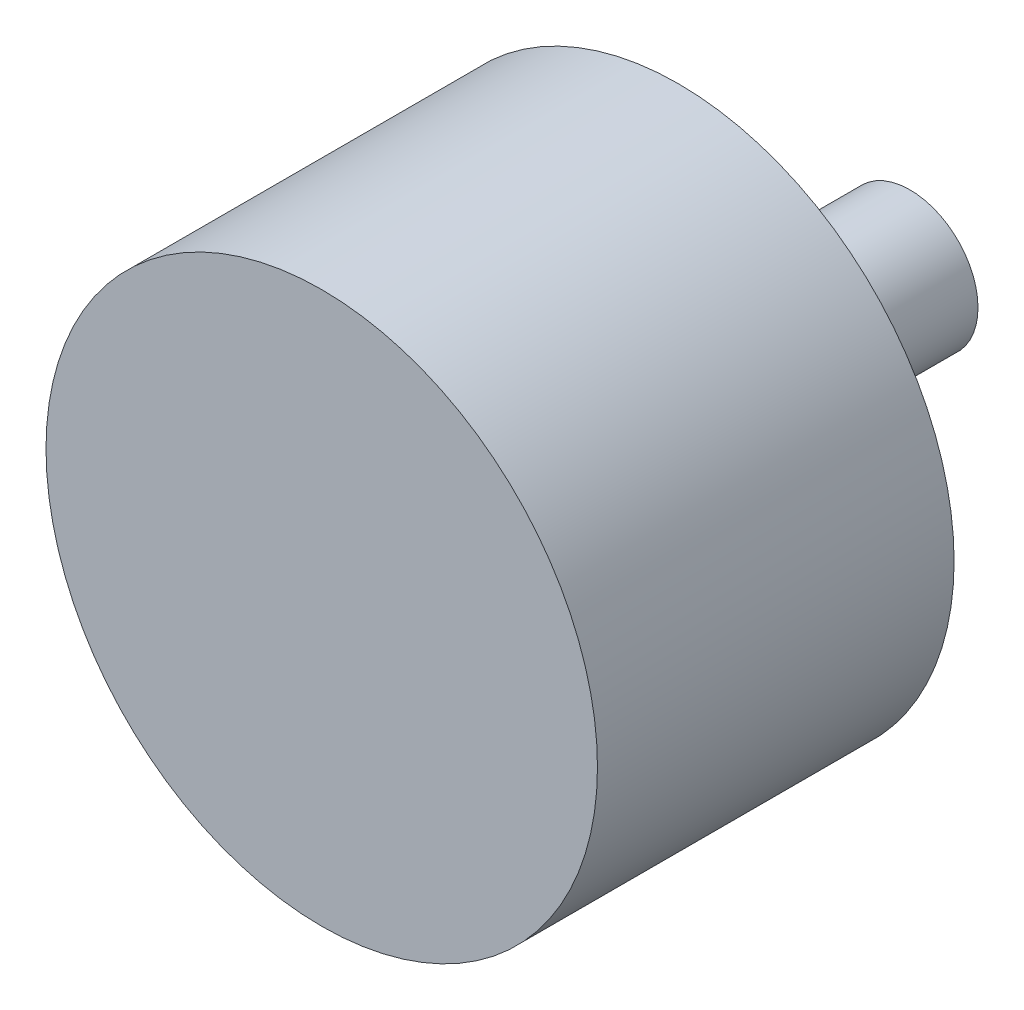
ISO-10303-21;
HEADER;
FILE_DESCRIPTION(('STEP AP214'),'2;1');
FILE_NAME('part.step','',(''),(''),'','','');
FILE_SCHEMA(('AUTOMOTIVE_DESIGN { 1 0 10303 214 1 1 1 1 }'));
ENDSEC;
DATA;
#1=APPLICATION_CONTEXT('core data for automotive mechanical design processes');
#2=APPLICATION_PROTOCOL_DEFINITION('international standard','automotive_design',2000,#1);
#3=PRODUCT_CONTEXT('',#1,'mechanical');
#4=PRODUCT('Part','Part','',(#3));
#5=PRODUCT_RELATED_PRODUCT_CATEGORY('part','',(#4));
#6=PRODUCT_DEFINITION_FORMATION('','',#4);
#7=PRODUCT_DEFINITION_CONTEXT('part definition',#1,'design');
#8=PRODUCT_DEFINITION('design','',#6,#7);
#9=PRODUCT_DEFINITION_SHAPE('','',#8);
#10=(LENGTH_UNIT() NAMED_UNIT(*) SI_UNIT(.MILLI.,.METRE.));
#11=(NAMED_UNIT(*) PLANE_ANGLE_UNIT() SI_UNIT($,.RADIAN.));
#12=(NAMED_UNIT(*) SI_UNIT($,.STERADIAN.) SOLID_ANGLE_UNIT());
#13=UNCERTAINTY_MEASURE_WITH_UNIT(LENGTH_MEASURE(1.E-05),#10,'distance_accuracy_value','');
#14=(GEOMETRIC_REPRESENTATION_CONTEXT(3) GLOBAL_UNCERTAINTY_ASSIGNED_CONTEXT((#13)) GLOBAL_UNIT_ASSIGNED_CONTEXT((#10,
#11,#12)) REPRESENTATION_CONTEXT('',''));
#15=CARTESIAN_POINT('',(0.,0.,0.));
#16=DIRECTION('',(0.,0.,1.));
#17=DIRECTION('',(1.,0.,0.));
#18=AXIS2_PLACEMENT_3D('',#15,#16,#17);
#19=CARTESIAN_POINT('',(0.,0.,0.));
#20=DIRECTION('',(0.,0.,-1.));
#21=DIRECTION('',(-1.,0.,0.));
#22=AXIS2_PLACEMENT_3D('',#19,#20,#21);
#23=PLANE('',#22);
#24=CARTESIAN_POINT('',(0.,0.,0.));
#25=DIRECTION('',(0.,0.,1.));
#26=DIRECTION('',(1.,0.,0.));
#27=AXIS2_PLACEMENT_3D('',#24,#25,#26);
#28=CIRCLE('',#27,19.05);
#29=CARTESIAN_POINT('',(19.05,0.,0.));
#30=VERTEX_POINT('',#29);
#31=EDGE_CURVE('E10',#30,#30,#28,.T.);
#32=ORIENTED_EDGE('',*,*,#31,.T.);
#33=EDGE_LOOP('',(#32));
#34=FACE_BOUND('',#33,.T.);
#35=ADVANCED_FACE('F30',(#34),#23,.F.);
#36=CARTESIAN_POINT('',(0.,0.,0.));
#37=DIRECTION('',(0.,0.,1.));
#38=DIRECTION('',(1.,0.,0.));
#39=AXIS2_PLACEMENT_3D('',#36,#37,#38);
#40=CYLINDRICAL_SURFACE('',#39,19.05);
#41=ORIENTED_EDGE('',*,*,#31,.F.);
#42=EDGE_LOOP('',(#41));
#43=FACE_BOUND('',#42,.T.);
#44=CARTESIAN_POINT('',(0.,0.,-24.638));
#45=DIRECTION('',(0.,0.,1.));
#46=DIRECTION('',(1.,0.,0.));
#47=AXIS2_PLACEMENT_3D('',#44,#45,#46);
#48=CIRCLE('',#47,19.05);
#49=CARTESIAN_POINT('',(19.05,0.,-24.638));
#50=VERTEX_POINT('',#49);
#51=EDGE_CURVE('E36',#50,#50,#48,.T.);
#52=ORIENTED_EDGE('',*,*,#51,.T.);
#53=EDGE_LOOP('',(#52));
#54=FACE_BOUND('',#53,.T.);
#55=ADVANCED_FACE('F68',(#43,#54),#40,.T.);
#56=CARTESIAN_POINT('',(0.,19.05,-24.638));
#57=DIRECTION('',(0.,0.,1.));
#58=DIRECTION('',(1.,0.,0.));
#59=AXIS2_PLACEMENT_3D('',#56,#57,#58);
#60=PLANE('',#59);
#61=ORIENTED_EDGE('',*,*,#51,.F.);
#62=EDGE_LOOP('',(#61));
#63=FACE_BOUND('',#62,.T.);
#64=CARTESIAN_POINT('',(0.,0.,-24.638));
#65=DIRECTION('',(0.,0.,1.));
#66=DIRECTION('',(1.,0.,0.));
#67=AXIS2_PLACEMENT_3D('',#64,#65,#66);
#68=CIRCLE('',#67,5.461);
#69=CARTESIAN_POINT('',(5.461,0.,-24.638));
#70=VERTEX_POINT('',#69);
#71=EDGE_CURVE('E40',#70,#70,#68,.T.);
#72=ORIENTED_EDGE('',*,*,#71,.T.);
#73=EDGE_LOOP('',(#72));
#74=FACE_BOUND('',#73,.T.);
#75=ADVANCED_FACE('F72',(#63,#74),#60,.F.);
#76=CARTESIAN_POINT('',(0.,0.,0.));
#77=DIRECTION('',(0.,0.,1.));
#78=DIRECTION('',(1.,0.,0.));
#79=AXIS2_PLACEMENT_3D('',#76,#77,#78);
#80=CYLINDRICAL_SURFACE('',#79,5.461);
#81=ORIENTED_EDGE('',*,*,#71,.F.);
#82=EDGE_LOOP('',(#81));
#83=FACE_BOUND('',#82,.T.);
#84=CARTESIAN_POINT('',(0.,0.,-30.48));
#85=DIRECTION('',(0.,0.,1.));
#86=DIRECTION('',(1.,0.,0.));
#87=AXIS2_PLACEMENT_3D('',#84,#85,#86);
#88=CIRCLE('',#87,5.461);
#89=CARTESIAN_POINT('',(5.461,0.,-30.48));
#90=VERTEX_POINT('',#89);
#91=EDGE_CURVE('E44',#90,#90,#88,.T.);
#92=ORIENTED_EDGE('',*,*,#91,.T.);
#93=EDGE_LOOP('',(#92));
#94=FACE_BOUND('',#93,.T.);
#95=ADVANCED_FACE('F77',(#83,#94),#80,.T.);
#96=CARTESIAN_POINT('',(0.,5.461,-30.48));
#97=DIRECTION('',(0.,0.,1.));
#98=DIRECTION('',(1.,0.,0.));
#99=AXIS2_PLACEMENT_3D('',#96,#97,#98);
#100=PLANE('',#99);
#101=ORIENTED_EDGE('',*,*,#91,.F.);
#102=EDGE_LOOP('',(#101));
#103=FACE_BOUND('',#102,.T.);
#104=CARTESIAN_POINT('',(0.,0.,-30.48));
#105=DIRECTION('',(0.,0.,1.));
#106=DIRECTION('',(1.,0.,0.));
#107=AXIS2_PLACEMENT_3D('',#104,#105,#106);
#108=CIRCLE('',#107,4.699);
#109=CARTESIAN_POINT('',(4.699,0.,-30.48));
#110=VERTEX_POINT('',#109);
#111=EDGE_CURVE('E49',#110,#110,#108,.T.);
#112=ORIENTED_EDGE('',*,*,#111,.T.);
#113=EDGE_LOOP('',(#112));
#114=FACE_BOUND('',#113,.T.);
#115=ADVANCED_FACE('F64',(#103,#114),#100,.F.);
#116=CARTESIAN_POINT('',(0.,0.,0.));
#117=DIRECTION('',(0.,0.,1.));
#118=DIRECTION('',(1.,0.,0.));
#119=AXIS2_PLACEMENT_3D('',#116,#117,#118);
#120=CYLINDRICAL_SURFACE('',#119,4.699);
#121=ORIENTED_EDGE('',*,*,#111,.F.);
#122=EDGE_LOOP('',(#121));
#123=FACE_BOUND('',#122,.T.);
#124=CARTESIAN_POINT('',(0.,0.,-40.64));
#125=DIRECTION('',(0.,0.,1.));
#126=DIRECTION('',(1.,0.,0.));
#127=AXIS2_PLACEMENT_3D('',#124,#125,#126);
#128=CIRCLE('',#127,4.699);
#129=CARTESIAN_POINT('',(4.699,0.,-40.64));
#130=VERTEX_POINT('',#129);
#131=EDGE_CURVE('E52',#130,#130,#128,.T.);
#132=ORIENTED_EDGE('',*,*,#131,.T.);
#133=EDGE_LOOP('',(#132));
#134=FACE_BOUND('',#133,.T.);
#135=ADVANCED_FACE('F56',(#123,#134),#120,.T.);
#136=CARTESIAN_POINT('',(0.,4.699,-40.64));
#137=DIRECTION('',(0.,0.,1.));
#138=DIRECTION('',(1.,0.,0.));
#139=AXIS2_PLACEMENT_3D('',#136,#137,#138);
#140=PLANE('',#139);
#141=ORIENTED_EDGE('',*,*,#131,.F.);
#142=EDGE_LOOP('',(#141));
#143=FACE_BOUND('',#142,.T.);
#144=ADVANCED_FACE('F58',(#143),#140,.F.);
#145=CLOSED_SHELL('',(#35,#55,#75,#95,#115,#135,#144));
#146=MANIFOLD_SOLID_BREP('B2',#145);
#147=ADVANCED_BREP_SHAPE_REPRESENTATION('',(#18,#146),#14);
#148=SHAPE_DEFINITION_REPRESENTATION(#9,#147);
ENDSEC;
END-ISO-10303-21;
